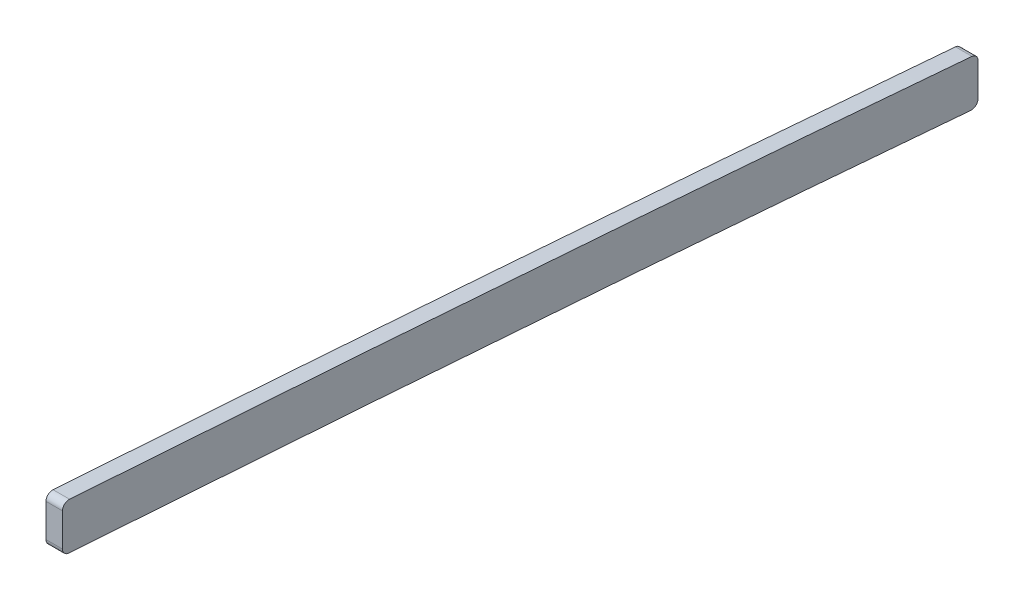
ISO-10303-21;
HEADER;
FILE_DESCRIPTION(('STEP AP214'),'2;1');
FILE_NAME('part.step','',(''),(''),'','','');
FILE_SCHEMA(('AUTOMOTIVE_DESIGN { 1 0 10303 214 1 1 1 1 }'));
ENDSEC;
DATA;
#1=APPLICATION_CONTEXT('core data for automotive mechanical design processes');
#2=APPLICATION_PROTOCOL_DEFINITION('international standard','automotive_design',2000,#1);
#3=PRODUCT_CONTEXT('',#1,'mechanical');
#4=PRODUCT('Part','Part','',(#3));
#5=PRODUCT_RELATED_PRODUCT_CATEGORY('part','',(#4));
#6=PRODUCT_DEFINITION_FORMATION('','',#4);
#7=PRODUCT_DEFINITION_CONTEXT('part definition',#1,'design');
#8=PRODUCT_DEFINITION('design','',#6,#7);
#9=PRODUCT_DEFINITION_SHAPE('','',#8);
#10=(LENGTH_UNIT() NAMED_UNIT(*) SI_UNIT(.MILLI.,.METRE.));
#11=(NAMED_UNIT(*) PLANE_ANGLE_UNIT() SI_UNIT($,.RADIAN.));
#12=(NAMED_UNIT(*) SI_UNIT($,.STERADIAN.) SOLID_ANGLE_UNIT());
#13=UNCERTAINTY_MEASURE_WITH_UNIT(LENGTH_MEASURE(1.E-05),#10,'distance_accuracy_value','');
#14=(GEOMETRIC_REPRESENTATION_CONTEXT(3) GLOBAL_UNCERTAINTY_ASSIGNED_CONTEXT((#13)) GLOBAL_UNIT_ASSIGNED_CONTEXT((#10,
#11,#12)) REPRESENTATION_CONTEXT('',''));
#15=CARTESIAN_POINT('',(0.,0.,0.));
#16=DIRECTION('',(0.,0.,1.));
#17=DIRECTION('',(1.,0.,0.));
#18=AXIS2_PLACEMENT_3D('',#15,#16,#17);
#19=CARTESIAN_POINT('',(1.5875,0.,0.));
#20=DIRECTION('',(1.,0.,0.));
#21=DIRECTION('',(0.,0.,-1.));
#22=AXIS2_PLACEMENT_3D('',#19,#20,#21);
#23=PLANE('',#22);
#24=CARTESIAN_POINT('',(1.5875,114.744712211049,-1735.36978708818));
#25=CARTESIAN_POINT('',(1.5875,110.735232017816,-1815.99594072318));
#26=CARTESIAN_POINT('',(1.5875,104.09636454831,-1936.9066504622));
#27=CARTESIAN_POINT('',(1.5875,94.1879787504419,-2098.04948516813));
#28=CARTESIAN_POINT('',(1.5875,87.3146385091305,-2198.69473672509));
#29=CARTESIAN_POINT('',(1.5875,81.1144189306114,-2279.13041374665));
#30=CARTESIAN_POINT('',(1.5875,76.0340766078011,-2339.41295030379));
#31=CARTESIAN_POINT('',(1.5875,70.2827054495217,-2399.56405433432));
#32=CARTESIAN_POINT('',(1.5875,61.1273782537238,-2479.57046826411));
#33=CARTESIAN_POINT('',(1.5875,49.6509076137669,-2559.29208787163));
#34=CARTESIAN_POINT('',(1.5875,38.2354847347183,-2626.79755458493));
#35=CARTESIAN_POINT('',(1.5875,32.3571302958871,-2659.27265183733));
#36=CARTESIAN_POINT('',(1.5875,28.6522110138429,-2679.06248770776));
#37=CARTESIAN_POINT('',(1.5875,26.3541994456866,-2690.94044026322));
#38=CARTESIAN_POINT('',(1.5875,24.9439248982718,-2698.06642332353));
#39=B_SPLINE_CURVE_WITH_KNOTS('',3,(#24,#25,#26,#27,#28,#29,#30,#31,#32,#33,#34,#35,#36,#37,
#38),.UNSPECIFIED.,.F.,.F.,(4,1,1,1,1,1,1,1,1,1,1,1,4),(0.,0.25,0.375,0.5,0.5625,0.625,0.6875,
0.75,0.875,0.9375,0.962410670199827,0.977446402119896,1.),.UNSPECIFIED.);
#40=CARTESIAN_POINT('',(1.5875,91.519678648898,-2136.37222712257));
#41=VERTEX_POINT('',#40);
#42=CARTESIAN_POINT('',(1.5875,78.4872851145334,-2310.02255532039));
#43=VERTEX_POINT('',#42);
#44=EDGE_CURVE('E113',#41,#43,#39,.T.);
#45=ORIENTED_EDGE('',*,*,#44,.T.);
#46=CARTESIAN_POINT('',(1.5875,79.752731929229,-2310.13));
#47=DIRECTION('',(1.,0.,0.));
#48=DIRECTION('',(0.,0.,-1.));
#49=AXIS2_PLACEMENT_3D('',#46,#47,#48);
#50=CIRCLE('',#49,1.27);
#51=CARTESIAN_POINT('',(1.5875,79.7527319292289,-2311.4));
#52=VERTEX_POINT('',#51);
#53=EDGE_CURVE('E245',#43,#52,#50,.T.);
#54=ORIENTED_EDGE('',*,*,#53,.T.);
#55=DIRECTION('',(0.,1.,0.));
#56=VECTOR('',#55,1.);
#57=CARTESIAN_POINT('',(1.5875,-1.15096295574831E-10,-2311.4));
#58=LINE('',#57,#56);
#59=CARTESIAN_POINT('',(1.5875,86.121800307132,-2311.4));
#60=VERTEX_POINT('',#59);
#61=EDGE_CURVE('E258',#52,#60,#58,.T.);
#62=ORIENTED_EDGE('',*,*,#61,.T.);
#63=CARTESIAN_POINT('',(1.5875,86.121800307132,-2310.13));
#64=DIRECTION('',(1.,0.,0.));
#65=DIRECTION('',(0.,0.,-1.));
#66=AXIS2_PLACEMENT_3D('',#63,#64,#65);
#67=CIRCLE('',#66,1.27);
#68=CARTESIAN_POINT('',(1.5875,87.3873581201983,-2310.23736802677));
#69=VERTEX_POINT('',#68);
#70=EDGE_CURVE('E166',#60,#69,#67,.T.);
#71=ORIENTED_EDGE('',*,*,#70,.T.);
#72=CARTESIAN_POINT('',(1.5875,100.417177393438,-2136.54276318493));
#73=CARTESIAN_POINT('',(1.5875,98.5571137716093,-2164.1860073924));
#74=CARTESIAN_POINT('',(1.5875,96.6188952190012,-2191.82395619038));
#75=CARTESIAN_POINT('',(1.5875,93.0801686873999,-2239.58699871448));
#76=CARTESIAN_POINT('',(1.5875,91.5298376215323,-2259.71628097743));
#77=CARTESIAN_POINT('',(1.5875,89.0908434299724,-2289.90044260235));
#78=CARTESIAN_POINT('',(1.5875,88.2588450388707,-2299.96017913521));
#79=CARTESIAN_POINT('',(1.5875,87.3996547943512,-2310.09118107085));
#80=CARTESIAN_POINT('',(1.5875,87.3934551380196,-2310.16427019507));
#81=CARTESIAN_POINT('',(1.5875,87.387254374734,-2310.23735922312));
#82=B_SPLINE_CURVE_WITH_KNOTS('',3,(#72,#73,#74,#75,#76,#77,#78,#79,#80,#81),.UNSPECIFIED.,.F.,
.F.,(4,2,2,2,4),(0.414227985667118,0.5,0.5625,0.59375,0.593977088680723),.UNSPECIFIED.);
#83=CARTESIAN_POINT('',(1.5875,100.41717746977,-2136.54276319007));
#84=VERTEX_POINT('',#83);
#85=EDGE_CURVE('E125',#84,#69,#82,.T.);
#86=ORIENTED_EDGE('',*,*,#85,.F.);
#87=CARTESIAN_POINT('',(1.5875,99.1500427560389,-2136.4575));
#88=DIRECTION('',(1.,0.,0.));
#89=DIRECTION('',(0.,0.,-1.));
#90=AXIS2_PLACEMENT_3D('',#87,#88,#89);
#91=CIRCLE('',#90,1.27);
#92=CARTESIAN_POINT('',(1.5875,99.1500427560389,-2135.1875));
#93=VERTEX_POINT('',#92);
#94=EDGE_CURVE('E158',#84,#93,#91,.T.);
#95=ORIENTED_EDGE('',*,*,#94,.T.);
#96=DIRECTION('',(0.,-1.,0.));
#97=VECTOR('',#96,1.);
#98=CARTESIAN_POINT('',(1.5875,0.,-2135.1875));
#99=LINE('',#98,#97);
#100=CARTESIAN_POINT('',(1.5875,92.7868126340687,-2135.1875));
#101=VERTEX_POINT('',#100);
#102=EDGE_CURVE('E153',#93,#101,#99,.T.);
#103=ORIENTED_EDGE('',*,*,#102,.T.);
#104=CARTESIAN_POINT('',(1.5875,92.7868126340687,-2136.4575));
#105=DIRECTION('',(1.,0.,0.));
#106=DIRECTION('',(0.,0.,-1.));
#107=AXIS2_PLACEMENT_3D('',#104,#105,#106);
#108=CIRCLE('',#107,1.27);
#109=EDGE_CURVE('E251',#101,#41,#108,.T.);
#110=ORIENTED_EDGE('',*,*,#109,.T.);
#111=EDGE_LOOP('',(#45,#54,#62,#71,#86,#95,#103,#110));
#112=FACE_BOUND('',#111,.T.);
#113=ADVANCED_FACE('F38',(#112),#23,.T.);
#114=CARTESIAN_POINT('',(-1.5875,0.,0.));
#115=DIRECTION('',(1.,0.,0.));
#116=DIRECTION('',(0.,0.,-1.));
#117=AXIS2_PLACEMENT_3D('',#114,#115,#116);
#118=PLANE('',#117);
#119=DIRECTION('',(0.,1.,0.));
#120=VECTOR('',#119,1.);
#121=CARTESIAN_POINT('',(-1.5875,-1.15096295574831E-10,-2311.4));
#122=LINE('',#121,#120);
#123=CARTESIAN_POINT('',(-1.5875,79.7527319292289,-2311.4));
#124=VERTEX_POINT('',#123);
#125=CARTESIAN_POINT('',(-1.5875,86.121800307132,-2311.4));
#126=VERTEX_POINT('',#125);
#127=EDGE_CURVE('E155',#124,#126,#122,.T.);
#128=ORIENTED_EDGE('',*,*,#127,.F.);
#129=CARTESIAN_POINT('',(-1.5875,79.752731929229,-2310.13));
#130=DIRECTION('',(1.,0.,0.));
#131=DIRECTION('',(0.,0.,-1.));
#132=AXIS2_PLACEMENT_3D('',#129,#130,#131);
#133=CIRCLE('',#132,1.27);
#134=CARTESIAN_POINT('',(-1.5875,78.4872851145334,-2310.02255532039));
#135=VERTEX_POINT('',#134);
#136=EDGE_CURVE('E124',#124,#135,#133,.F.);
#137=ORIENTED_EDGE('',*,*,#136,.T.);
#138=CARTESIAN_POINT('',(-1.5875,114.744712211049,-1735.36978708818));
#139=CARTESIAN_POINT('',(-1.5875,110.735232017816,-1815.99594072318));
#140=CARTESIAN_POINT('',(-1.5875,104.09636454831,-1936.9066504622));
#141=CARTESIAN_POINT('',(-1.5875,94.1879787504419,-2098.04948516813));
#142=CARTESIAN_POINT('',(-1.5875,87.3146385091305,-2198.69473672509));
#143=CARTESIAN_POINT('',(-1.5875,81.1144189306114,-2279.13041374665));
#144=CARTESIAN_POINT('',(-1.5875,76.0340766078011,-2339.41295030379));
#145=CARTESIAN_POINT('',(-1.5875,70.2827054495217,-2399.56405433432));
#146=CARTESIAN_POINT('',(-1.5875,61.1273782537238,-2479.57046826411));
#147=CARTESIAN_POINT('',(-1.5875,49.6509076137669,-2559.29208787163));
#148=CARTESIAN_POINT('',(-1.5875,38.2354847347183,-2626.79755458493));
#149=CARTESIAN_POINT('',(-1.5875,32.3571302958871,-2659.27265183733));
#150=CARTESIAN_POINT('',(-1.5875,28.6522110138429,-2679.06248770776));
#151=CARTESIAN_POINT('',(-1.5875,26.3541994456866,-2690.94044026322));
#152=CARTESIAN_POINT('',(-1.5875,24.9439248982718,-2698.06642332353));
#153=B_SPLINE_CURVE_WITH_KNOTS('',3,(#138,#139,#140,#141,#142,#143,#144,#145,#146,#147,#148,
#149,#150,#151,#152),.UNSPECIFIED.,.F.,.F.,(4,1,1,1,1,1,1,1,1,1,1,1,4),(0.,0.25,0.375,0.5,
0.5625,0.625,0.6875,0.75,0.875,0.9375,0.962410670199827,0.977446402119896,1.),.UNSPECIFIED.);
#154=CARTESIAN_POINT('',(-1.5875,91.519678648898,-2136.37222712257));
#155=VERTEX_POINT('',#154);
#156=EDGE_CURVE('E110',#155,#135,#153,.T.);
#157=ORIENTED_EDGE('',*,*,#156,.F.);
#158=CARTESIAN_POINT('',(-1.5875,92.7868126340687,-2136.4575));
#159=DIRECTION('',(1.,0.,0.));
#160=DIRECTION('',(0.,0.,-1.));
#161=AXIS2_PLACEMENT_3D('',#158,#159,#160);
#162=CIRCLE('',#161,1.27);
#163=CARTESIAN_POINT('',(-1.5875,92.7868126340687,-2135.1875));
#164=VERTEX_POINT('',#163);
#165=EDGE_CURVE('E121',#155,#164,#162,.F.);
#166=ORIENTED_EDGE('',*,*,#165,.T.);
#167=DIRECTION('',(0.,-1.,0.));
#168=VECTOR('',#167,1.);
#169=CARTESIAN_POINT('',(-1.5875,0.,-2135.1875));
#170=LINE('',#169,#168);
#171=CARTESIAN_POINT('',(-1.5875,99.1500427560389,-2135.1875));
#172=VERTEX_POINT('',#171);
#173=EDGE_CURVE('E117',#172,#164,#170,.T.);
#174=ORIENTED_EDGE('',*,*,#173,.F.);
#175=CARTESIAN_POINT('',(-1.5875,99.1500427560389,-2136.4575));
#176=DIRECTION('',(1.,0.,0.));
#177=DIRECTION('',(0.,0.,-1.));
#178=AXIS2_PLACEMENT_3D('',#175,#176,#177);
#179=CIRCLE('',#178,1.27);
#180=CARTESIAN_POINT('',(-1.5875,100.417176047924,-2136.54276309439));
#181=VERTEX_POINT('',#180);
#182=EDGE_CURVE('E60',#172,#181,#179,.F.);
#183=ORIENTED_EDGE('',*,*,#182,.T.);
#184=CARTESIAN_POINT('',(-1.5875,87.387254374394,-2310.23735922713));
#185=CARTESIAN_POINT('',(-1.5875,87.3934551377931,-2310.16427019774));
#186=CARTESIAN_POINT('',(-1.5875,87.399654794238,-2310.09118107218));
#187=CARTESIAN_POINT('',(-1.5875,88.2588450388707,-2299.96017913521));
#188=CARTESIAN_POINT('',(-1.5875,89.0908434299724,-2289.90044260235));
#189=CARTESIAN_POINT('',(-1.5875,91.5298376215323,-2259.71628097743));
#190=CARTESIAN_POINT('',(-1.5875,93.0801686873999,-2239.58699871448));
#191=CARTESIAN_POINT('',(-1.5875,96.6188952190014,-2191.82395619037));
#192=CARTESIAN_POINT('',(-1.5875,98.5571137716097,-2164.18600739239));
#193=CARTESIAN_POINT('',(-1.5875,100.417177393438,-2136.54276318492));
#194=B_SPLINE_CURVE_WITH_KNOTS('',3,(#184,#185,#186,#187,#188,#189,#190,#191,#192,#193),
.UNSPECIFIED.,.F.,.F.,(4,2,2,2,4),(0.414227985667109,0.414455074351982,0.445705074351982,
0.508205074351982,0.593977088684873),.UNSPECIFIED.);
#195=CARTESIAN_POINT('',(-1.5875,87.3873576545853,-2310.23736798927));
#196=VERTEX_POINT('',#195);
#197=EDGE_CURVE('E126',#181,#196,#194,.F.);
#198=ORIENTED_EDGE('',*,*,#197,.T.);
#199=CARTESIAN_POINT('',(-1.5875,86.121800307132,-2310.13));
#200=DIRECTION('',(1.,0.,0.));
#201=DIRECTION('',(0.,0.,-1.));
#202=AXIS2_PLACEMENT_3D('',#199,#200,#201);
#203=CIRCLE('',#202,1.27);
#204=EDGE_CURVE('E130',#196,#126,#203,.F.);
#205=ORIENTED_EDGE('',*,*,#204,.T.);
#206=EDGE_LOOP('',(#128,#137,#157,#166,#174,#183,#198,#205));
#207=FACE_BOUND('',#206,.T.);
#208=ADVANCED_FACE('F120',(#207),#118,.F.);
#209=DIRECTION('',(1.,0.,0.));
#210=VECTOR('',#209,1.);
#211=SURFACE_OF_LINEAR_EXTRUSION('',#153,#210);
#212=ORIENTED_EDGE('',*,*,#156,.T.);
#213=DIRECTION('',(1.,0.,0.));
#214=VECTOR('',#213,1.);
#215=CARTESIAN_POINT('',(-1.5875,78.4872851145334,-2310.02255532039));
#216=LINE('',#215,#214);
#217=EDGE_CURVE('E116',#135,#43,#216,.T.);
#218=ORIENTED_EDGE('',*,*,#217,.T.);
#219=ORIENTED_EDGE('',*,*,#44,.F.);
#220=DIRECTION('',(1.,0.,0.));
#221=VECTOR('',#220,1.);
#222=CARTESIAN_POINT('',(1.5875,91.519678648898,-2136.37222712257));
#223=LINE('',#222,#221);
#224=EDGE_CURVE('E106',#41,#155,#223,.F.);
#225=ORIENTED_EDGE('',*,*,#224,.T.);
#226=EDGE_LOOP('',(#212,#218,#219,#225));
#227=FACE_BOUND('',#226,.T.);
#228=ADVANCED_FACE('F108',(#227),#211,.T.);
#229=CARTESIAN_POINT('',(-1.5875,123.62374006878,-1735.81133470922));
#230=CARTESIAN_POINT('',(-1.5875,121.618292624347,-1776.13863549866));
#231=CARTESIAN_POINT('',(-1.5875,119.500621805793,-1816.46028157928));
#232=CARTESIAN_POINT('',(-1.5875,115.087561884835,-1897.09366867468));
#233=CARTESIAN_POINT('',(-1.5875,112.792971084113,-1937.4056388964));
#234=CARTESIAN_POINT('',(-1.5875,108.01836652323,-2018.0184190449));
#235=CARTESIAN_POINT('',(-1.5875,105.539122976217,-2058.31951222306));
#236=CARTESIAN_POINT('',(-1.5875,100.307240032155,-2138.90378014414));
#237=CARTESIAN_POINT('',(-1.5875,97.5551279550714,-2179.18739792965));
#238=CARTESIAN_POINT('',(-1.5875,93.0801686873999,-2239.58699871448));
#239=CARTESIAN_POINT('',(-1.5875,91.5298376215323,-2259.71628097743));
#240=CARTESIAN_POINT('',(-1.5875,89.0908434299724,-2289.90044260235));
#241=CARTESIAN_POINT('',(-1.5875,88.2588450388707,-2299.96017913521));
#242=CARTESIAN_POINT('',(-1.5875,86.5528616543479,-2320.0760045662));
#243=CARTESIAN_POINT('',(-1.5875,85.6789622226699,-2330.13210089761));
#244=CARTESIAN_POINT('',(-1.5875,83.8743348466212,-2350.23935651754));
#245=CARTESIAN_POINT('',(-1.5875,82.9433074844211,-2360.29048979378));
#246=CARTESIAN_POINT('',(-1.5875,81.0031832968026,-2380.3859739712));
#247=CARTESIAN_POINT('',(-1.5875,79.9934185550902,-2390.43006537759));
#248=CARTESIAN_POINT('',(-1.5875,76.8275775323524,-2420.5470261948));
#249=CARTESIAN_POINT('',(-1.5875,74.5336729547823,-2440.6064858901));
#250=CARTESIAN_POINT('',(-1.5875,69.5562785225382,-2480.67556956821));
#251=CARTESIAN_POINT('',(-1.5875,66.8741508113434,-2500.6871518296));
#252=CARTESIAN_POINT('',(-1.5875,61.1502462952664,-2540.65429020717));
#253=CARTESIAN_POINT('',(-1.5875,58.1097556460363,-2560.61102642776));
#254=CARTESIAN_POINT('',(-1.5875,51.7024655740435,-2600.47545713133));
#255=CARTESIAN_POINT('',(-1.5875,48.3375388880153,-2620.38296708947));
#256=CARTESIAN_POINT('',(-1.5875,43.0416957000558,-2650.1996164959));
#257=CARTESIAN_POINT('',(-1.5875,41.2345222277721,-2660.13118962649));
#258=CARTESIAN_POINT('',(-1.5875,37.5258634945269,-2679.97612471736));
#259=CARTESIAN_POINT('',(-1.5875,35.6245635215631,-2689.88973979233));
#260=CARTESIAN_POINT('',(-1.5875,33.6647813022258,-2699.79233281757));
#261=B_SPLINE_CURVE_WITH_KNOTS('',3,(#229,#230,#231,#232,#233,#234,#235,#236,#237,#238,#239,
#240,#241,#242,#243,#244,#245,#246,#247,#248,#249,#250,#251,#252,#253,#254,#255,#256,#257,#258,
#259,#260),.UNSPECIFIED.,.F.,.F.,(4,2,2,2,2,2,2,2,2,2,2,2,2,2,2,4),(0.,0.125,0.25,0.375,0.5,
0.5625,0.59375,0.625,0.65625,0.6875,0.75,0.8125,0.875,0.9375,0.96875,1.),.UNSPECIFIED.);
#262=DIRECTION('',(1.,0.,0.));
#263=VECTOR('',#262,1.);
#264=SURFACE_OF_LINEAR_EXTRUSION('',#261,#263);
#265=ORIENTED_EDGE('',*,*,#85,.T.);
#266=DIRECTION('',(1.,0.,0.));
#267=VECTOR('',#266,1.);
#268=CARTESIAN_POINT('',(1.5875,87.3872543749054,-2310.2373592211));
#269=LINE('',#268,#267);
#270=EDGE_CURVE('E53',#69,#196,#269,.F.);
#271=ORIENTED_EDGE('',*,*,#270,.T.);
#272=ORIENTED_EDGE('',*,*,#197,.F.);
#273=DIRECTION('',(1.,0.,0.));
#274=VECTOR('',#273,1.);
#275=CARTESIAN_POINT('',(-1.5875,100.417177393438,-2136.54276318493));
#276=LINE('',#275,#274);
#277=EDGE_CURVE('E141',#181,#84,#276,.T.);
#278=ORIENTED_EDGE('',*,*,#277,.T.);
#279=EDGE_LOOP('',(#265,#271,#272,#278));
#280=FACE_BOUND('',#279,.T.);
#281=ADVANCED_FACE('F160',(#280),#264,.F.);
#282=CARTESIAN_POINT('',(-1.59250269714593,-1.15096295574831E-10,-2311.4));
#283=DIRECTION('',(0.,0.,-1.));
#284=DIRECTION('',(0.,1.,0.));
#285=AXIS2_PLACEMENT_3D('',#282,#283,#284);
#286=PLANE('',#285);
#287=ORIENTED_EDGE('',*,*,#61,.F.);
#288=DIRECTION('',(1.,0.,0.));
#289=VECTOR('',#288,1.);
#290=CARTESIAN_POINT('',(-1.59250269714593,79.7527319292289,-2311.4));
#291=LINE('',#290,#289);
#292=EDGE_CURVE('E133',#52,#124,#291,.F.);
#293=ORIENTED_EDGE('',*,*,#292,.T.);
#294=ORIENTED_EDGE('',*,*,#127,.T.);
#295=DIRECTION('',(-1.,0.,0.));
#296=VECTOR('',#295,1.);
#297=CARTESIAN_POINT('',(1.5875,86.121800307132,-2311.4));
#298=LINE('',#297,#296);
#299=EDGE_CURVE('E247',#126,#60,#298,.F.);
#300=ORIENTED_EDGE('',*,*,#299,.T.);
#301=EDGE_LOOP('',(#287,#293,#294,#300));
#302=FACE_BOUND('',#301,.T.);
#303=ADVANCED_FACE('F193',(#302),#286,.T.);
#304=CARTESIAN_POINT('',(-1.59250269714593,0.,-2135.1875));
#305=DIRECTION('',(0.,0.,1.));
#306=DIRECTION('',(1.,0.,0.));
#307=AXIS2_PLACEMENT_3D('',#304,#305,#306);
#308=PLANE('',#307);
#309=ORIENTED_EDGE('',*,*,#173,.T.);
#310=DIRECTION('',(1.,0.,0.));
#311=VECTOR('',#310,1.);
#312=CARTESIAN_POINT('',(-1.59250269714593,92.7868126340687,-2135.1875));
#313=LINE('',#312,#311);
#314=EDGE_CURVE('E11',#164,#101,#313,.T.);
#315=ORIENTED_EDGE('',*,*,#314,.T.);
#316=ORIENTED_EDGE('',*,*,#102,.F.);
#317=DIRECTION('',(-1.,0.,0.));
#318=VECTOR('',#317,1.);
#319=CARTESIAN_POINT('',(-1.59250269714593,99.1500427560389,-2135.1875));
#320=LINE('',#319,#318);
#321=EDGE_CURVE('E46',#93,#172,#320,.T.);
#322=ORIENTED_EDGE('',*,*,#321,.T.);
#323=EDGE_LOOP('',(#309,#315,#316,#322));
#324=FACE_BOUND('',#323,.T.);
#325=ADVANCED_FACE('F151',(#324),#308,.T.);
#326=CARTESIAN_POINT('',(0.,79.752731929229,-2310.13));
#327=DIRECTION('',(1.,0.,0.));
#328=DIRECTION('',(0.,0.,-1.));
#329=AXIS2_PLACEMENT_3D('',#326,#327,#328);
#330=CYLINDRICAL_SURFACE('',#329,1.27);
#331=ORIENTED_EDGE('',*,*,#136,.F.);
#332=ORIENTED_EDGE('',*,*,#292,.F.);
#333=ORIENTED_EDGE('',*,*,#53,.F.);
#334=ORIENTED_EDGE('',*,*,#217,.F.);
#335=EDGE_LOOP('',(#331,#332,#333,#334));
#336=FACE_BOUND('',#335,.T.);
#337=ADVANCED_FACE('F199',(#336),#330,.T.);
#338=CARTESIAN_POINT('',(-0.00250134857296565,86.121800307132,-2310.13));
#339=DIRECTION('',(1.,0.,0.));
#340=DIRECTION('',(0.,0.,-1.));
#341=AXIS2_PLACEMENT_3D('',#338,#339,#340);
#342=CYLINDRICAL_SURFACE('',#341,1.27);
#343=ORIENTED_EDGE('',*,*,#204,.F.);
#344=ORIENTED_EDGE('',*,*,#270,.F.);
#345=ORIENTED_EDGE('',*,*,#70,.F.);
#346=ORIENTED_EDGE('',*,*,#299,.F.);
#347=EDGE_LOOP('',(#343,#344,#345,#346));
#348=FACE_BOUND('',#347,.T.);
#349=ADVANCED_FACE('F268',(#348),#342,.T.);
#350=CARTESIAN_POINT('',(0.,92.7868126340687,-2136.4575));
#351=DIRECTION('',(1.,0.,0.));
#352=DIRECTION('',(0.,0.,-1.));
#353=AXIS2_PLACEMENT_3D('',#350,#351,#352);
#354=CYLINDRICAL_SURFACE('',#353,1.27);
#355=ORIENTED_EDGE('',*,*,#165,.F.);
#356=ORIENTED_EDGE('',*,*,#224,.F.);
#357=ORIENTED_EDGE('',*,*,#109,.F.);
#358=ORIENTED_EDGE('',*,*,#314,.F.);
#359=EDGE_LOOP('',(#355,#356,#357,#358));
#360=FACE_BOUND('',#359,.T.);
#361=ADVANCED_FACE('F129',(#360),#354,.T.);
#362=CARTESIAN_POINT('',(-0.00250134857296565,99.1500427560389,-2136.4575));
#363=DIRECTION('',(1.,0.,0.));
#364=DIRECTION('',(0.,0.,-1.));
#365=AXIS2_PLACEMENT_3D('',#362,#363,#364);
#366=CYLINDRICAL_SURFACE('',#365,1.27);
#367=ORIENTED_EDGE('',*,*,#182,.F.);
#368=ORIENTED_EDGE('',*,*,#321,.F.);
#369=ORIENTED_EDGE('',*,*,#94,.F.);
#370=ORIENTED_EDGE('',*,*,#277,.F.);
#371=EDGE_LOOP('',(#367,#368,#369,#370));
#372=FACE_BOUND('',#371,.T.);
#373=ADVANCED_FACE('F40',(#372),#366,.T.);
#374=CLOSED_SHELL('',(#113,#208,#228,#281,#303,#325,#337,#349,#361,#373));
#375=MANIFOLD_SOLID_BREP('B2',#374);
#376=ADVANCED_BREP_SHAPE_REPRESENTATION('',(#18,#375),#14);
#377=SHAPE_DEFINITION_REPRESENTATION(#9,#376);
ENDSEC;
END-ISO-10303-21;
